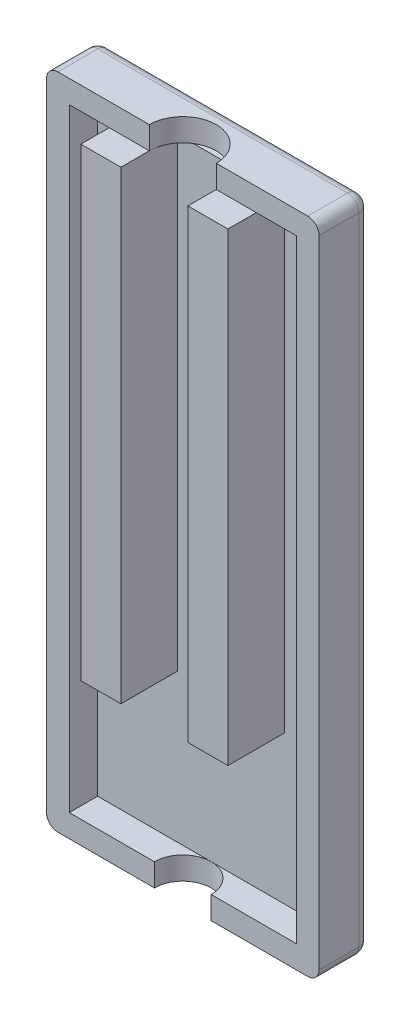
ISO-10303-21;
HEADER;
FILE_DESCRIPTION(('STEP AP214'),'2;1');
FILE_NAME('part.step','',(''),(''),'','','');
FILE_SCHEMA(('AUTOMOTIVE_DESIGN { 1 0 10303 214 1 1 1 1 }'));
ENDSEC;
DATA;
#1=APPLICATION_CONTEXT('core data for automotive mechanical design processes');
#2=APPLICATION_PROTOCOL_DEFINITION('international standard','automotive_design',2000,#1);
#3=PRODUCT_CONTEXT('',#1,'mechanical');
#4=PRODUCT('Part','Part','',(#3));
#5=PRODUCT_RELATED_PRODUCT_CATEGORY('part','',(#4));
#6=PRODUCT_DEFINITION_FORMATION('','',#4);
#7=PRODUCT_DEFINITION_CONTEXT('part definition',#1,'design');
#8=PRODUCT_DEFINITION('design','',#6,#7);
#9=PRODUCT_DEFINITION_SHAPE('','',#8);
#10=(LENGTH_UNIT() NAMED_UNIT(*) SI_UNIT(.MILLI.,.METRE.));
#11=(NAMED_UNIT(*) PLANE_ANGLE_UNIT() SI_UNIT($,.RADIAN.));
#12=(NAMED_UNIT(*) SI_UNIT($,.STERADIAN.) SOLID_ANGLE_UNIT());
#13=UNCERTAINTY_MEASURE_WITH_UNIT(LENGTH_MEASURE(1.E-05),#10,'distance_accuracy_value','');
#14=(GEOMETRIC_REPRESENTATION_CONTEXT(3) GLOBAL_UNCERTAINTY_ASSIGNED_CONTEXT((#13)) GLOBAL_UNIT_ASSIGNED_CONTEXT((#10,
#11,#12)) REPRESENTATION_CONTEXT('',''));
#15=CARTESIAN_POINT('',(0.,0.,0.));
#16=DIRECTION('',(0.,0.,1.));
#17=DIRECTION('',(1.,0.,0.));
#18=AXIS2_PLACEMENT_3D('',#15,#16,#17);
#19=CARTESIAN_POINT('',(0.,0.,2.));
#20=DIRECTION('',(0.,0.,1.));
#21=DIRECTION('',(1.,0.,0.));
#22=AXIS2_PLACEMENT_3D('',#19,#20,#21);
#23=PLANE('',#22);
#24=DIRECTION('',(1.,0.,0.));
#25=VECTOR('',#24,1.);
#26=CARTESIAN_POINT('',(2.95000000000001,-9.92651978231253,2.));
#27=LINE('',#26,#25);
#28=CARTESIAN_POINT('',(2.95000000000001,-9.92651978231253,2.));
#29=VERTEX_POINT('',#28);
#30=CARTESIAN_POINT('',(6.475,-9.92651978231253,2.));
#31=VERTEX_POINT('',#30);
#32=EDGE_CURVE('E265',#29,#31,#27,.T.);
#33=ORIENTED_EDGE('',*,*,#32,.F.);
#34=DIRECTION('',(0.,-1.,0.));
#35=VECTOR('',#34,1.);
#36=CARTESIAN_POINT('',(2.95,31.,2.));
#37=LINE('',#36,#35);
#38=CARTESIAN_POINT('',(2.95,31.,2.));
#39=VERTEX_POINT('',#38);
#40=EDGE_CURVE('E289',#39,#29,#37,.T.);
#41=ORIENTED_EDGE('',*,*,#40,.F.);
#42=DIRECTION('',(1.,0.,0.));
#43=VECTOR('',#42,1.);
#44=CARTESIAN_POINT('',(0.,31.,2.));
#45=LINE('',#44,#43);
#46=CARTESIAN_POINT('',(1.56604597633659,31.,2.));
#47=VERTEX_POINT('',#46);
#48=EDGE_CURVE('E552',#47,#39,#45,.T.);
#49=ORIENTED_EDGE('',*,*,#48,.F.);
#50=CARTESIAN_POINT('',(-1.56604597633658,31.,2.));
#51=VERTEX_POINT('',#50);
#52=EDGE_CURVE('E403',#51,#47,#45,.T.);
#53=ORIENTED_EDGE('',*,*,#52,.F.);
#54=CARTESIAN_POINT('',(-2.95,31.,2.));
#55=VERTEX_POINT('',#54);
#56=EDGE_CURVE('E402',#55,#51,#45,.T.);
#57=ORIENTED_EDGE('',*,*,#56,.F.);
#58=DIRECTION('',(0.,1.,0.));
#59=VECTOR('',#58,1.);
#60=CARTESIAN_POINT('',(-2.95,31.,2.));
#61=LINE('',#60,#59);
#62=CARTESIAN_POINT('',(-2.95,-9.92651978231253,2.));
#63=VERTEX_POINT('',#62);
#64=EDGE_CURVE('E275',#63,#55,#61,.T.);
#65=ORIENTED_EDGE('',*,*,#64,.F.);
#66=DIRECTION('',(1.,0.,0.));
#67=VECTOR('',#66,1.);
#68=CARTESIAN_POINT('',(-2.95,-9.92651978231253,2.));
#69=LINE('',#68,#67);
#70=CARTESIAN_POINT('',(-6.475,-9.92651978231253,2.));
#71=VERTEX_POINT('',#70);
#72=EDGE_CURVE('E288',#71,#63,#69,.T.);
#73=ORIENTED_EDGE('',*,*,#72,.F.);
#74=DIRECTION('',(0.,-1.,0.));
#75=VECTOR('',#74,1.);
#76=CARTESIAN_POINT('',(-6.475,31.,2.));
#77=LINE('',#76,#75);
#78=CARTESIAN_POINT('',(-6.475,31.,2.));
#79=VERTEX_POINT('',#78);
#80=EDGE_CURVE('E285',#79,#71,#77,.T.);
#81=ORIENTED_EDGE('',*,*,#80,.F.);
#82=CARTESIAN_POINT('',(-10.,31.,2.));
#83=VERTEX_POINT('',#82);
#84=EDGE_CURVE('E354',#83,#79,#45,.T.);
#85=ORIENTED_EDGE('',*,*,#84,.F.);
#86=DIRECTION('',(0.,-1.,0.));
#87=VECTOR('',#86,1.);
#88=CARTESIAN_POINT('',(-10.,0.,2.));
#89=LINE('',#88,#87);
#90=CARTESIAN_POINT('',(-9.99999999999999,-23.,2.));
#91=VERTEX_POINT('',#90);
#92=EDGE_CURVE('E394',#83,#91,#89,.T.);
#93=ORIENTED_EDGE('',*,*,#92,.T.);
#94=DIRECTION('',(1.,0.,0.));
#95=VECTOR('',#94,1.);
#96=CARTESIAN_POINT('',(0.,-23.,2.));
#97=LINE('',#96,#95);
#98=CARTESIAN_POINT('',(0.,-23.,2.));
#99=VERTEX_POINT('',#98);
#100=EDGE_CURVE('E390',#91,#99,#97,.T.);
#101=ORIENTED_EDGE('',*,*,#100,.T.);
#102=CARTESIAN_POINT('',(10.,-23.,2.));
#103=VERTEX_POINT('',#102);
#104=EDGE_CURVE('E389',#99,#103,#97,.T.);
#105=ORIENTED_EDGE('',*,*,#104,.T.);
#106=DIRECTION('',(0.,1.,0.));
#107=VECTOR('',#106,1.);
#108=CARTESIAN_POINT('',(10.,0.,2.));
#109=LINE('',#108,#107);
#110=CARTESIAN_POINT('',(10.,31.,2.));
#111=VERTEX_POINT('',#110);
#112=EDGE_CURVE('E345',#103,#111,#109,.T.);
#113=ORIENTED_EDGE('',*,*,#112,.T.);
#114=CARTESIAN_POINT('',(6.475,31.,2.));
#115=VERTEX_POINT('',#114);
#116=EDGE_CURVE('E398',#115,#111,#45,.T.);
#117=ORIENTED_EDGE('',*,*,#116,.F.);
#118=DIRECTION('',(0.,1.,0.));
#119=VECTOR('',#118,1.);
#120=CARTESIAN_POINT('',(6.475,31.,2.));
#121=LINE('',#120,#119);
#122=EDGE_CURVE('E260',#31,#115,#121,.T.);
#123=ORIENTED_EDGE('',*,*,#122,.F.);
#124=EDGE_LOOP('',(#33,#41,#49,#53,#57,#65,#73,#81,#85,#93,#101,#105,#113,#117,#123));
#125=FACE_BOUND('',#124,.T.);
#126=ADVANCED_FACE('F45',(#125),#23,.T.);
#127=CARTESIAN_POINT('',(0.,31.,4.5));
#128=DIRECTION('',(0.,1.,0.));
#129=DIRECTION('',(0.,0.,1.));
#130=AXIS2_PLACEMENT_3D('',#127,#128,#129);
#131=PLANE('',#130);
#132=DIRECTION('',(0.,0.,-1.));
#133=VECTOR('',#132,1.);
#134=CARTESIAN_POINT('',(2.95,31.,7.));
#135=LINE('',#134,#133);
#136=CARTESIAN_POINT('',(2.95,31.,4.5));
#137=VERTEX_POINT('',#136);
#138=EDGE_CURVE('E520',#137,#39,#135,.T.);
#139=ORIENTED_EDGE('',*,*,#138,.F.);
#140=CARTESIAN_POINT('',(0.,31.,4.5));
#141=DIRECTION('',(0.,-1.,0.));
#142=DIRECTION('',(0.,0.,-1.));
#143=AXIS2_PLACEMENT_3D('',#140,#141,#142);
#144=CIRCLE('',#143,2.95);
#145=EDGE_CURVE('E327',#47,#137,#144,.T.);
#146=ORIENTED_EDGE('',*,*,#145,.F.);
#147=ORIENTED_EDGE('',*,*,#48,.T.);
#148=EDGE_LOOP('',(#139,#146,#147));
#149=FACE_BOUND('',#148,.T.);
#150=ADVANCED_FACE('F569',(#149),#131,.F.);
#151=DIRECTION('',(0.,0.,-1.));
#152=VECTOR('',#151,1.);
#153=CARTESIAN_POINT('',(6.475,31.,7.));
#154=LINE('',#153,#152);
#155=CARTESIAN_POINT('',(6.475,31.,4.5));
#156=VERTEX_POINT('',#155);
#157=EDGE_CURVE('E251',#156,#115,#154,.T.);
#158=ORIENTED_EDGE('',*,*,#157,.T.);
#159=ORIENTED_EDGE('',*,*,#116,.T.);
#160=DIRECTION('',(0.,0.,-1.));
#161=VECTOR('',#160,1.);
#162=CARTESIAN_POINT('',(10.,31.,4.5));
#163=LINE('',#162,#161);
#164=CARTESIAN_POINT('',(10.,31.,4.5));
#165=VERTEX_POINT('',#164);
#166=EDGE_CURVE('E385',#165,#111,#163,.T.);
#167=ORIENTED_EDGE('',*,*,#166,.F.);
#168=DIRECTION('',(1.,0.,0.));
#169=VECTOR('',#168,1.);
#170=CARTESIAN_POINT('',(0.,31.,4.5));
#171=LINE('',#170,#169);
#172=EDGE_CURVE('E363',#156,#165,#171,.T.);
#173=ORIENTED_EDGE('',*,*,#172,.F.);
#174=EDGE_LOOP('',(#158,#159,#167,#173));
#175=FACE_BOUND('',#174,.T.);
#176=ADVANCED_FACE('F547',(#175),#131,.F.);
#177=DIRECTION('',(0.,0.,-1.));
#178=VECTOR('',#177,1.);
#179=CARTESIAN_POINT('',(-6.475,31.,7.));
#180=LINE('',#179,#178);
#181=CARTESIAN_POINT('',(-6.475,31.,4.5));
#182=VERTEX_POINT('',#181);
#183=EDGE_CURVE('E306',#182,#79,#180,.T.);
#184=ORIENTED_EDGE('',*,*,#183,.F.);
#185=CARTESIAN_POINT('',(-10.,31.,4.5));
#186=VERTEX_POINT('',#185);
#187=EDGE_CURVE('E364',#186,#182,#171,.T.);
#188=ORIENTED_EDGE('',*,*,#187,.F.);
#189=DIRECTION('',(0.,0.,-1.));
#190=VECTOR('',#189,1.);
#191=CARTESIAN_POINT('',(-10.,31.,4.5));
#192=LINE('',#191,#190);
#193=EDGE_CURVE('E407',#186,#83,#192,.T.);
#194=ORIENTED_EDGE('',*,*,#193,.T.);
#195=ORIENTED_EDGE('',*,*,#84,.T.);
#196=EDGE_LOOP('',(#184,#188,#194,#195));
#197=FACE_BOUND('',#196,.T.);
#198=ADVANCED_FACE('F576',(#197),#131,.F.);
#199=DIRECTION('',(0.,0.,-1.));
#200=VECTOR('',#199,1.);
#201=CARTESIAN_POINT('',(-2.95,31.,7.));
#202=LINE('',#201,#200);
#203=CARTESIAN_POINT('',(-2.95,31.,4.5));
#204=VERTEX_POINT('',#203);
#205=EDGE_CURVE('E284',#204,#55,#202,.T.);
#206=ORIENTED_EDGE('',*,*,#205,.T.);
#207=ORIENTED_EDGE('',*,*,#56,.T.);
#208=EDGE_CURVE('E336',#204,#51,#144,.T.);
#209=ORIENTED_EDGE('',*,*,#208,.F.);
#210=EDGE_LOOP('',(#206,#207,#209));
#211=FACE_BOUND('',#210,.T.);
#212=ADVANCED_FACE('F687',(#211),#131,.F.);
#213=CARTESIAN_POINT('',(0.,-23.,4.5));
#214=DIRECTION('',(0.,1.,0.));
#215=DIRECTION('',(0.,0.,1.));
#216=AXIS2_PLACEMENT_3D('',#213,#214,#215);
#217=PLANE('',#216);
#218=CARTESIAN_POINT('',(0.,-23.,4.5));
#219=DIRECTION('',(0.,1.,0.));
#220=DIRECTION('',(0.,0.,1.));
#221=AXIS2_PLACEMENT_3D('',#218,#219,#220);
#222=CIRCLE('',#221,2.5);
#223=CARTESIAN_POINT('',(2.5,-23.,4.5));
#224=VERTEX_POINT('',#223);
#225=EDGE_CURVE('E321',#224,#99,#222,.T.);
#226=ORIENTED_EDGE('',*,*,#225,.F.);
#227=DIRECTION('',(1.,0.,0.));
#228=VECTOR('',#227,1.);
#229=CARTESIAN_POINT('',(0.,-23.,4.5));
#230=LINE('',#229,#228);
#231=CARTESIAN_POINT('',(10.,-23.,4.5));
#232=VERTEX_POINT('',#231);
#233=EDGE_CURVE('E353',#224,#232,#230,.T.);
#234=ORIENTED_EDGE('',*,*,#233,.T.);
#235=DIRECTION('',(0.,0.,-1.));
#236=VECTOR('',#235,1.);
#237=CARTESIAN_POINT('',(10.,-23.,4.5));
#238=LINE('',#237,#236);
#239=EDGE_CURVE('E414',#232,#103,#238,.T.);
#240=ORIENTED_EDGE('',*,*,#239,.T.);
#241=ORIENTED_EDGE('',*,*,#104,.F.);
#242=EDGE_LOOP('',(#226,#234,#240,#241));
#243=FACE_BOUND('',#242,.T.);
#244=ADVANCED_FACE('F710',(#243),#217,.T.);
#245=CARTESIAN_POINT('',(0.,0.,4.5));
#246=DIRECTION('',(0.,0.,1.));
#247=DIRECTION('',(1.,0.,0.));
#248=AXIS2_PLACEMENT_3D('',#245,#246,#247);
#249=PLANE('',#248);
#250=DIRECTION('',(1.,0.,0.));
#251=VECTOR('',#250,1.);
#252=CARTESIAN_POINT('',(0.,-25.,4.5));
#253=LINE('',#252,#251);
#254=CARTESIAN_POINT('',(2.5,-25.,4.5));
#255=VERTEX_POINT('',#254);
#256=CARTESIAN_POINT('',(11.,-25.,4.5));
#257=VERTEX_POINT('',#256);
#258=EDGE_CURVE('E368',#255,#257,#253,.T.);
#259=ORIENTED_EDGE('',*,*,#258,.T.);
#260=CARTESIAN_POINT('',(11.,-24.,4.5));
#261=DIRECTION('',(0.,0.,1.));
#262=DIRECTION('',(1.,0.,0.));
#263=AXIS2_PLACEMENT_3D('',#260,#261,#262);
#264=CIRCLE('',#263,1.);
#265=CARTESIAN_POINT('',(12.,-24.,4.5));
#266=VERTEX_POINT('',#265);
#267=EDGE_CURVE('E440',#257,#266,#264,.T.);
#268=ORIENTED_EDGE('',*,*,#267,.T.);
#269=DIRECTION('',(0.,1.,0.));
#270=VECTOR('',#269,1.);
#271=CARTESIAN_POINT('',(12.,0.,4.5));
#272=LINE('',#271,#270);
#273=CARTESIAN_POINT('',(12.,32.,4.5));
#274=VERTEX_POINT('',#273);
#275=EDGE_CURVE('E373',#266,#274,#272,.T.);
#276=ORIENTED_EDGE('',*,*,#275,.T.);
#277=CARTESIAN_POINT('',(11.,32.,4.5));
#278=DIRECTION('',(0.,0.,1.));
#279=DIRECTION('',(1.,0.,0.));
#280=AXIS2_PLACEMENT_3D('',#277,#278,#279);
#281=CIRCLE('',#280,1.);
#282=CARTESIAN_POINT('',(11.,33.,4.5));
#283=VERTEX_POINT('',#282);
#284=EDGE_CURVE('E437',#274,#283,#281,.T.);
#285=ORIENTED_EDGE('',*,*,#284,.T.);
#286=DIRECTION('',(-1.,0.,0.));
#287=VECTOR('',#286,1.);
#288=CARTESIAN_POINT('',(0.,33.,4.5));
#289=LINE('',#288,#287);
#290=CARTESIAN_POINT('',(2.95,33.,4.5));
#291=VERTEX_POINT('',#290);
#292=EDGE_CURVE('E378',#283,#291,#289,.T.);
#293=ORIENTED_EDGE('',*,*,#292,.T.);
#294=DIRECTION('',(0.,-1.,0.));
#295=VECTOR('',#294,1.);
#296=CARTESIAN_POINT('',(2.95,33.,4.5));
#297=LINE('',#296,#295);
#298=EDGE_CURVE('E335',#291,#137,#297,.T.);
#299=ORIENTED_EDGE('',*,*,#298,.T.);
#300=EDGE_CURVE('E369',#137,#156,#171,.T.);
#301=ORIENTED_EDGE('',*,*,#300,.T.);
#302=ORIENTED_EDGE('',*,*,#172,.T.);
#303=DIRECTION('',(0.,1.,0.));
#304=VECTOR('',#303,1.);
#305=CARTESIAN_POINT('',(10.,0.,4.5));
#306=LINE('',#305,#304);
#307=EDGE_CURVE('E349',#232,#165,#306,.T.);
#308=ORIENTED_EDGE('',*,*,#307,.F.);
#309=ORIENTED_EDGE('',*,*,#233,.F.);
#310=DIRECTION('',(0.,1.,0.));
#311=VECTOR('',#310,1.);
#312=CARTESIAN_POINT('',(2.5,-25.,4.5));
#313=LINE('',#312,#311);
#314=EDGE_CURVE('E324',#255,#224,#313,.T.);
#315=ORIENTED_EDGE('',*,*,#314,.F.);
#316=EDGE_LOOP('',(#259,#268,#276,#285,#293,#299,#301,#302,#308,#309,#315));
#317=FACE_BOUND('',#316,.T.);
#318=ADVANCED_FACE('F599',(#317),#249,.T.);
#319=CARTESIAN_POINT('',(12.,33.,2.));
#320=DIRECTION('',(-1.,0.,0.));
#321=DIRECTION('',(0.,-1.,0.));
#322=AXIS2_PLACEMENT_3D('',#319,#320,#321);
#323=PLANE('',#322);
#324=ORIENTED_EDGE('',*,*,#275,.F.);
#325=DIRECTION('',(0.,0.,-1.));
#326=VECTOR('',#325,1.);
#327=CARTESIAN_POINT('',(12.,-24.,2.));
#328=LINE('',#327,#326);
#329=CARTESIAN_POINT('',(12.,-24.,1.));
#330=VERTEX_POINT('',#329);
#331=EDGE_CURVE('E424',#266,#330,#328,.T.);
#332=ORIENTED_EDGE('',*,*,#331,.T.);
#333=DIRECTION('',(0.,1.,0.));
#334=VECTOR('',#333,1.);
#335=CARTESIAN_POINT('',(12.,33.,1.));
#336=LINE('',#335,#334);
#337=CARTESIAN_POINT('',(12.,32.,1.));
#338=VERTEX_POINT('',#337);
#339=EDGE_CURVE('E421',#330,#338,#336,.T.);
#340=ORIENTED_EDGE('',*,*,#339,.T.);
#341=DIRECTION('',(0.,0.,-1.));
#342=VECTOR('',#341,1.);
#343=CARTESIAN_POINT('',(12.,32.,2.));
#344=LINE('',#343,#342);
#345=EDGE_CURVE('E418',#338,#274,#344,.F.);
#346=ORIENTED_EDGE('',*,*,#345,.T.);
#347=EDGE_LOOP('',(#324,#332,#340,#346));
#348=FACE_BOUND('',#347,.T.);
#349=ADVANCED_FACE('F596',(#348),#323,.F.);
#350=CARTESIAN_POINT('',(-12.,33.,2.));
#351=DIRECTION('',(0.,-1.,0.));
#352=DIRECTION('',(1.,0.,0.));
#353=AXIS2_PLACEMENT_3D('',#350,#351,#352);
#354=PLANE('',#353);
#355=DIRECTION('',(-1.,0.,0.));
#356=VECTOR('',#355,1.);
#357=CARTESIAN_POINT('',(-12.,33.,1.));
#358=LINE('',#357,#356);
#359=CARTESIAN_POINT('',(11.,33.,1.));
#360=VERTEX_POINT('',#359);
#361=CARTESIAN_POINT('',(-11.,33.,1.));
#362=VERTEX_POINT('',#361);
#363=EDGE_CURVE('E55',#360,#362,#358,.T.);
#364=ORIENTED_EDGE('',*,*,#363,.T.);
#365=DIRECTION('',(0.,0.,-1.));
#366=VECTOR('',#365,1.);
#367=CARTESIAN_POINT('',(-11.,33.,2.));
#368=LINE('',#367,#366);
#369=CARTESIAN_POINT('',(-11.,33.,4.5));
#370=VERTEX_POINT('',#369);
#371=EDGE_CURVE('E11',#362,#370,#368,.F.);
#372=ORIENTED_EDGE('',*,*,#371,.T.);
#373=CARTESIAN_POINT('',(-2.95,33.,4.5));
#374=VERTEX_POINT('',#373);
#375=EDGE_CURVE('E377',#374,#370,#289,.T.);
#376=ORIENTED_EDGE('',*,*,#375,.F.);
#377=CARTESIAN_POINT('',(0.,33.,4.5));
#378=DIRECTION('',(0.,-1.,0.));
#379=DIRECTION('',(0.,0.,-1.));
#380=AXIS2_PLACEMENT_3D('',#377,#378,#379);
#381=CIRCLE('',#380,2.95);
#382=EDGE_CURVE('E331',#374,#291,#381,.T.);
#383=ORIENTED_EDGE('',*,*,#382,.T.);
#384=ORIENTED_EDGE('',*,*,#292,.F.);
#385=DIRECTION('',(0.,0.,-1.));
#386=VECTOR('',#385,1.);
#387=CARTESIAN_POINT('',(11.,33.,2.));
#388=LINE('',#387,#386);
#389=EDGE_CURVE('E66',#283,#360,#388,.T.);
#390=ORIENTED_EDGE('',*,*,#389,.T.);
#391=EDGE_LOOP('',(#364,#372,#376,#383,#384,#390));
#392=FACE_BOUND('',#391,.T.);
#393=ADVANCED_FACE('F592',(#392),#354,.F.);
#394=CARTESIAN_POINT('',(-12.,33.,2.));
#395=DIRECTION('',(1.,0.,0.));
#396=DIRECTION('',(0.,1.,0.));
#397=AXIS2_PLACEMENT_3D('',#394,#395,#396);
#398=PLANE('',#397);
#399=DIRECTION('',(0.,-1.,0.));
#400=VECTOR('',#399,1.);
#401=CARTESIAN_POINT('',(-12.,33.,1.));
#402=LINE('',#401,#400);
#403=CARTESIAN_POINT('',(-12.,32.,1.));
#404=VERTEX_POINT('',#403);
#405=CARTESIAN_POINT('',(-12.,-24.,1.));
#406=VERTEX_POINT('',#405);
#407=EDGE_CURVE('E459',#404,#406,#402,.T.);
#408=ORIENTED_EDGE('',*,*,#407,.T.);
#409=DIRECTION('',(0.,0.,-1.));
#410=VECTOR('',#409,1.);
#411=CARTESIAN_POINT('',(-12.,-24.,2.));
#412=LINE('',#411,#410);
#413=CARTESIAN_POINT('',(-12.,-24.,4.5));
#414=VERTEX_POINT('',#413);
#415=EDGE_CURVE('E462',#406,#414,#412,.F.);
#416=ORIENTED_EDGE('',*,*,#415,.T.);
#417=DIRECTION('',(0.,-1.,0.));
#418=VECTOR('',#417,1.);
#419=CARTESIAN_POINT('',(-12.,0.,4.5));
#420=LINE('',#419,#418);
#421=CARTESIAN_POINT('',(-12.,32.,4.5));
#422=VERTEX_POINT('',#421);
#423=EDGE_CURVE('E381',#422,#414,#420,.T.);
#424=ORIENTED_EDGE('',*,*,#423,.F.);
#425=DIRECTION('',(0.,0.,-1.));
#426=VECTOR('',#425,1.);
#427=CARTESIAN_POINT('',(-12.,32.,2.));
#428=LINE('',#427,#426);
#429=EDGE_CURVE('E456',#422,#404,#428,.T.);
#430=ORIENTED_EDGE('',*,*,#429,.T.);
#431=EDGE_LOOP('',(#408,#416,#424,#430));
#432=FACE_BOUND('',#431,.T.);
#433=ADVANCED_FACE('F588',(#432),#398,.F.);
#434=CARTESIAN_POINT('',(-12.,-25.,2.));
#435=DIRECTION('',(0.,1.,0.));
#436=DIRECTION('',(0.,0.,1.));
#437=AXIS2_PLACEMENT_3D('',#434,#435,#436);
#438=PLANE('',#437);
#439=DIRECTION('',(1.,0.,0.));
#440=VECTOR('',#439,1.);
#441=CARTESIAN_POINT('',(-12.,-25.,1.));
#442=LINE('',#441,#440);
#443=CARTESIAN_POINT('',(-11.,-25.,1.));
#444=VERTEX_POINT('',#443);
#445=CARTESIAN_POINT('',(11.,-25.,1.));
#446=VERTEX_POINT('',#445);
#447=EDGE_CURVE('E431',#444,#446,#442,.T.);
#448=ORIENTED_EDGE('',*,*,#447,.T.);
#449=DIRECTION('',(0.,0.,-1.));
#450=VECTOR('',#449,1.);
#451=CARTESIAN_POINT('',(11.,-25.,2.));
#452=LINE('',#451,#450);
#453=EDGE_CURVE('E434',#446,#257,#452,.F.);
#454=ORIENTED_EDGE('',*,*,#453,.T.);
#455=ORIENTED_EDGE('',*,*,#258,.F.);
#456=CARTESIAN_POINT('',(0.,-25.,4.5));
#457=DIRECTION('',(0.,1.,0.));
#458=DIRECTION('',(0.,0.,1.));
#459=AXIS2_PLACEMENT_3D('',#456,#457,#458);
#460=CIRCLE('',#459,2.5);
#461=CARTESIAN_POINT('',(-2.5,-25.,4.5));
#462=VERTEX_POINT('',#461);
#463=EDGE_CURVE('E316',#255,#462,#460,.T.);
#464=ORIENTED_EDGE('',*,*,#463,.T.);
#465=CARTESIAN_POINT('',(-11.,-25.,4.5));
#466=VERTEX_POINT('',#465);
#467=EDGE_CURVE('E370',#466,#462,#253,.T.);
#468=ORIENTED_EDGE('',*,*,#467,.F.);
#469=DIRECTION('',(0.,0.,-1.));
#470=VECTOR('',#469,1.);
#471=CARTESIAN_POINT('',(-11.,-25.,2.));
#472=LINE('',#471,#470);
#473=EDGE_CURVE('E428',#466,#444,#472,.T.);
#474=ORIENTED_EDGE('',*,*,#473,.T.);
#475=EDGE_LOOP('',(#448,#454,#455,#464,#468,#474));
#476=FACE_BOUND('',#475,.T.);
#477=ADVANCED_FACE('F584',(#476),#438,.F.);
#478=CARTESIAN_POINT('',(0.,0.,0.));
#479=DIRECTION('',(0.,0.,1.));
#480=DIRECTION('',(1.,0.,0.));
#481=AXIS2_PLACEMENT_3D('',#478,#479,#480);
#482=PLANE('',#481);
#483=DIRECTION('',(0.,1.,0.));
#484=VECTOR('',#483,1.);
#485=CARTESIAN_POINT('',(11.,0.,0.));
#486=LINE('',#485,#484);
#487=CARTESIAN_POINT('',(11.,32.,0.));
#488=VERTEX_POINT('',#487);
#489=CARTESIAN_POINT('',(11.,-24.,0.));
#490=VERTEX_POINT('',#489);
#491=EDGE_CURVE('E443',#488,#490,#486,.F.);
#492=ORIENTED_EDGE('',*,*,#491,.T.);
#493=DIRECTION('',(1.,0.,0.));
#494=VECTOR('',#493,1.);
#495=CARTESIAN_POINT('',(0.,-24.,0.));
#496=LINE('',#495,#494);
#497=CARTESIAN_POINT('',(-11.,-24.,0.));
#498=VERTEX_POINT('',#497);
#499=EDGE_CURVE('E452',#490,#498,#496,.F.);
#500=ORIENTED_EDGE('',*,*,#499,.T.);
#501=DIRECTION('',(0.,-1.,0.));
#502=VECTOR('',#501,1.);
#503=CARTESIAN_POINT('',(-11.,0.,0.));
#504=LINE('',#503,#502);
#505=CARTESIAN_POINT('',(-11.,32.,0.));
#506=VERTEX_POINT('',#505);
#507=EDGE_CURVE('E449',#498,#506,#504,.F.);
#508=ORIENTED_EDGE('',*,*,#507,.T.);
#509=DIRECTION('',(-1.,0.,0.));
#510=VECTOR('',#509,1.);
#511=CARTESIAN_POINT('',(0.,32.,0.));
#512=LINE('',#511,#510);
#513=EDGE_CURVE('E446',#506,#488,#512,.F.);
#514=ORIENTED_EDGE('',*,*,#513,.T.);
#515=EDGE_LOOP('',(#492,#500,#508,#514));
#516=FACE_BOUND('',#515,.T.);
#517=ADVANCED_FACE('F581',(#516),#482,.F.);
#518=CARTESIAN_POINT('',(10.,0.,4.5));
#519=DIRECTION('',(-1.,0.,0.));
#520=DIRECTION('',(0.,0.,1.));
#521=AXIS2_PLACEMENT_3D('',#518,#519,#520);
#522=PLANE('',#521);
#523=ORIENTED_EDGE('',*,*,#112,.F.);
#524=ORIENTED_EDGE('',*,*,#239,.F.);
#525=ORIENTED_EDGE('',*,*,#307,.T.);
#526=ORIENTED_EDGE('',*,*,#166,.T.);
#527=EDGE_LOOP('',(#523,#524,#525,#526));
#528=FACE_BOUND('',#527,.T.);
#529=ADVANCED_FACE('F579',(#528),#522,.T.);
#530=CARTESIAN_POINT('',(-2.5,-23.,4.5));
#531=VERTEX_POINT('',#530);
#532=EDGE_CURVE('E315',#99,#531,#222,.T.);
#533=ORIENTED_EDGE('',*,*,#532,.F.);
#534=ORIENTED_EDGE('',*,*,#100,.F.);
#535=DIRECTION('',(0.,0.,-1.));
#536=VECTOR('',#535,1.);
#537=CARTESIAN_POINT('',(-9.99999999999999,-23.,4.5));
#538=LINE('',#537,#536);
#539=CARTESIAN_POINT('',(-9.99999999999999,-23.,4.5));
#540=VERTEX_POINT('',#539);
#541=EDGE_CURVE('E411',#540,#91,#538,.T.);
#542=ORIENTED_EDGE('',*,*,#541,.F.);
#543=EDGE_CURVE('E355',#540,#531,#230,.T.);
#544=ORIENTED_EDGE('',*,*,#543,.T.);
#545=EDGE_LOOP('',(#533,#534,#542,#544));
#546=FACE_BOUND('',#545,.T.);
#547=ADVANCED_FACE('F715',(#546),#217,.T.);
#548=CARTESIAN_POINT('',(-10.,0.,4.5));
#549=DIRECTION('',(1.,0.,0.));
#550=DIRECTION('',(0.,1.,0.));
#551=AXIS2_PLACEMENT_3D('',#548,#549,#550);
#552=PLANE('',#551);
#553=ORIENTED_EDGE('',*,*,#92,.F.);
#554=ORIENTED_EDGE('',*,*,#193,.F.);
#555=DIRECTION('',(0.,-1.,0.));
#556=VECTOR('',#555,1.);
#557=CARTESIAN_POINT('',(-10.,0.,4.5));
#558=LINE('',#557,#556);
#559=EDGE_CURVE('E359',#186,#540,#558,.T.);
#560=ORIENTED_EDGE('',*,*,#559,.T.);
#561=ORIENTED_EDGE('',*,*,#541,.T.);
#562=EDGE_LOOP('',(#553,#554,#560,#561));
#563=FACE_BOUND('',#562,.T.);
#564=ADVANCED_FACE('F719',(#563),#552,.T.);
#565=ORIENTED_EDGE('',*,*,#423,.T.);
#566=CARTESIAN_POINT('',(-11.,-24.,4.5));
#567=DIRECTION('',(0.,0.,1.));
#568=DIRECTION('',(1.,0.,0.));
#569=AXIS2_PLACEMENT_3D('',#566,#567,#568);
#570=CIRCLE('',#569,1.);
#571=EDGE_CURVE('E468',#414,#466,#570,.T.);
#572=ORIENTED_EDGE('',*,*,#571,.T.);
#573=ORIENTED_EDGE('',*,*,#467,.T.);
#574=DIRECTION('',(0.,1.,0.));
#575=VECTOR('',#574,1.);
#576=CARTESIAN_POINT('',(-2.5,-25.,4.5));
#577=LINE('',#576,#575);
#578=EDGE_CURVE('E320',#462,#531,#577,.T.);
#579=ORIENTED_EDGE('',*,*,#578,.T.);
#580=ORIENTED_EDGE('',*,*,#543,.F.);
#581=ORIENTED_EDGE('',*,*,#559,.F.);
#582=ORIENTED_EDGE('',*,*,#187,.T.);
#583=DIRECTION('',(1.,0.,0.));
#584=VECTOR('',#583,1.);
#585=CARTESIAN_POINT('',(0.,31.,4.5));
#586=LINE('',#585,#584);
#587=EDGE_CURVE('E311',#182,#204,#586,.T.);
#588=ORIENTED_EDGE('',*,*,#587,.T.);
#589=DIRECTION('',(0.,-1.,0.));
#590=VECTOR('',#589,1.);
#591=CARTESIAN_POINT('',(-2.95,33.,4.5));
#592=LINE('',#591,#590);
#593=EDGE_CURVE('E341',#374,#204,#592,.T.);
#594=ORIENTED_EDGE('',*,*,#593,.F.);
#595=ORIENTED_EDGE('',*,*,#375,.T.);
#596=CARTESIAN_POINT('',(-11.,32.,4.5));
#597=DIRECTION('',(0.,0.,1.));
#598=DIRECTION('',(1.,0.,0.));
#599=AXIS2_PLACEMENT_3D('',#596,#597,#598);
#600=CIRCLE('',#599,1.);
#601=EDGE_CURVE('E465',#370,#422,#600,.T.);
#602=ORIENTED_EDGE('',*,*,#601,.T.);
#603=EDGE_LOOP('',(#565,#572,#573,#579,#580,#581,#582,#588,#594,#595,#602));
#604=FACE_BOUND('',#603,.T.);
#605=ADVANCED_FACE('F657',(#604),#249,.T.);
#606=CARTESIAN_POINT('',(0.,33.,4.5));
#607=DIRECTION('',(0.,-1.,0.));
#608=DIRECTION('',(0.,0.,-1.));
#609=AXIS2_PLACEMENT_3D('',#606,#607,#608);
#610=CYLINDRICAL_SURFACE('',#609,2.95);
#611=ORIENTED_EDGE('',*,*,#208,.T.);
#612=EDGE_CURVE('E340',#51,#47,#144,.T.);
#613=ORIENTED_EDGE('',*,*,#612,.T.);
#614=ORIENTED_EDGE('',*,*,#145,.T.);
#615=ORIENTED_EDGE('',*,*,#298,.F.);
#616=ORIENTED_EDGE('',*,*,#382,.F.);
#617=ORIENTED_EDGE('',*,*,#593,.T.);
#618=EDGE_LOOP('',(#611,#613,#614,#615,#616,#617));
#619=FACE_BOUND('',#618,.T.);
#620=ADVANCED_FACE('F698',(#619),#610,.F.);
#621=CARTESIAN_POINT('',(0.,31.,4.5));
#622=DIRECTION('',(0.,-1.,0.));
#623=DIRECTION('',(0.,0.,-1.));
#624=AXIS2_PLACEMENT_3D('',#621,#622,#623);
#625=PLANE('',#624);
#626=ORIENTED_EDGE('',*,*,#52,.T.);
#627=ORIENTED_EDGE('',*,*,#612,.F.);
#628=EDGE_LOOP('',(#626,#627));
#629=FACE_BOUND('',#628,.T.);
#630=ADVANCED_FACE('F695',(#629),#625,.F.);
#631=CARTESIAN_POINT('',(0.,-25.,4.5));
#632=DIRECTION('',(0.,1.,0.));
#633=DIRECTION('',(0.,0.,1.));
#634=AXIS2_PLACEMENT_3D('',#631,#632,#633);
#635=CYLINDRICAL_SURFACE('',#634,2.5);
#636=ORIENTED_EDGE('',*,*,#225,.T.);
#637=ORIENTED_EDGE('',*,*,#532,.T.);
#638=ORIENTED_EDGE('',*,*,#578,.F.);
#639=ORIENTED_EDGE('',*,*,#463,.F.);
#640=ORIENTED_EDGE('',*,*,#314,.T.);
#641=EDGE_LOOP('',(#636,#637,#638,#639,#640));
#642=FACE_BOUND('',#641,.T.);
#643=ADVANCED_FACE('F663',(#642),#635,.F.);
#644=CARTESIAN_POINT('',(-6.475,31.,7.));
#645=DIRECTION('',(0.,-1.,0.));
#646=DIRECTION('',(0.,0.,-1.));
#647=AXIS2_PLACEMENT_3D('',#644,#645,#646);
#648=PLANE('',#647);
#649=ORIENTED_EDGE('',*,*,#587,.F.);
#650=CARTESIAN_POINT('',(-6.475,31.,7.));
#651=VERTEX_POINT('',#650);
#652=EDGE_CURVE('E307',#651,#182,#180,.T.);
#653=ORIENTED_EDGE('',*,*,#652,.F.);
#654=DIRECTION('',(-1.,0.,0.));
#655=VECTOR('',#654,1.);
#656=CARTESIAN_POINT('',(-6.475,31.,7.));
#657=LINE('',#656,#655);
#658=CARTESIAN_POINT('',(-2.95,31.,7.));
#659=VERTEX_POINT('',#658);
#660=EDGE_CURVE('E270',#659,#651,#657,.T.);
#661=ORIENTED_EDGE('',*,*,#660,.F.);
#662=EDGE_CURVE('E295',#659,#204,#202,.T.);
#663=ORIENTED_EDGE('',*,*,#662,.T.);
#664=EDGE_LOOP('',(#649,#653,#661,#663));
#665=FACE_BOUND('',#664,.T.);
#666=ADVANCED_FACE('F736',(#665),#648,.F.);
#667=CARTESIAN_POINT('',(-6.475,31.,7.));
#668=DIRECTION('',(1.,0.,0.));
#669=DIRECTION('',(0.,1.,0.));
#670=AXIS2_PLACEMENT_3D('',#667,#668,#669);
#671=PLANE('',#670);
#672=ORIENTED_EDGE('',*,*,#80,.T.);
#673=DIRECTION('',(0.,0.,-1.));
#674=VECTOR('',#673,1.);
#675=CARTESIAN_POINT('',(-6.475,-9.92651978231253,7.));
#676=LINE('',#675,#674);
#677=CARTESIAN_POINT('',(-6.475,-9.92651978231253,7.));
#678=VERTEX_POINT('',#677);
#679=EDGE_CURVE('E302',#678,#71,#676,.T.);
#680=ORIENTED_EDGE('',*,*,#679,.F.);
#681=DIRECTION('',(0.,-1.,0.));
#682=VECTOR('',#681,1.);
#683=CARTESIAN_POINT('',(-6.475,31.,7.));
#684=LINE('',#683,#682);
#685=EDGE_CURVE('E274',#651,#678,#684,.T.);
#686=ORIENTED_EDGE('',*,*,#685,.F.);
#687=ORIENTED_EDGE('',*,*,#652,.T.);
#688=ORIENTED_EDGE('',*,*,#183,.T.);
#689=EDGE_LOOP('',(#672,#680,#686,#687,#688));
#690=FACE_BOUND('',#689,.T.);
#691=ADVANCED_FACE('F725',(#690),#671,.F.);
#692=CARTESIAN_POINT('',(-2.95,-9.92651978231253,7.));
#693=DIRECTION('',(0.,1.,0.));
#694=DIRECTION('',(-1.,0.,0.));
#695=AXIS2_PLACEMENT_3D('',#692,#693,#694);
#696=PLANE('',#695);
#697=ORIENTED_EDGE('',*,*,#72,.T.);
#698=DIRECTION('',(0.,0.,-1.));
#699=VECTOR('',#698,1.);
#700=CARTESIAN_POINT('',(-2.95,-9.92651978231253,7.));
#701=LINE('',#700,#699);
#702=CARTESIAN_POINT('',(-2.95,-9.92651978231253,7.));
#703=VERTEX_POINT('',#702);
#704=EDGE_CURVE('E299',#703,#63,#701,.T.);
#705=ORIENTED_EDGE('',*,*,#704,.F.);
#706=DIRECTION('',(1.,0.,0.));
#707=VECTOR('',#706,1.);
#708=CARTESIAN_POINT('',(-2.95,-9.92651978231253,7.));
#709=LINE('',#708,#707);
#710=EDGE_CURVE('E278',#678,#703,#709,.T.);
#711=ORIENTED_EDGE('',*,*,#710,.F.);
#712=ORIENTED_EDGE('',*,*,#679,.T.);
#713=EDGE_LOOP('',(#697,#705,#711,#712));
#714=FACE_BOUND('',#713,.T.);
#715=ADVANCED_FACE('F730',(#714),#696,.F.);
#716=CARTESIAN_POINT('',(-2.95,31.,7.));
#717=DIRECTION('',(-1.,0.,0.));
#718=DIRECTION('',(0.,-1.,0.));
#719=AXIS2_PLACEMENT_3D('',#716,#717,#718);
#720=PLANE('',#719);
#721=ORIENTED_EDGE('',*,*,#64,.T.);
#722=ORIENTED_EDGE('',*,*,#205,.F.);
#723=ORIENTED_EDGE('',*,*,#662,.F.);
#724=DIRECTION('',(0.,1.,0.));
#725=VECTOR('',#724,1.);
#726=CARTESIAN_POINT('',(-2.95,31.,7.));
#727=LINE('',#726,#725);
#728=EDGE_CURVE('E281',#703,#659,#727,.T.);
#729=ORIENTED_EDGE('',*,*,#728,.F.);
#730=ORIENTED_EDGE('',*,*,#704,.T.);
#731=EDGE_LOOP('',(#721,#722,#723,#729,#730));
#732=FACE_BOUND('',#731,.T.);
#733=ADVANCED_FACE('F737',(#732),#720,.F.);
#734=CARTESIAN_POINT('',(0.,0.,7.));
#735=DIRECTION('',(0.,0.,-1.));
#736=DIRECTION('',(-1.,0.,0.));
#737=AXIS2_PLACEMENT_3D('',#734,#735,#736);
#738=PLANE('',#737);
#739=ORIENTED_EDGE('',*,*,#660,.T.);
#740=ORIENTED_EDGE('',*,*,#685,.T.);
#741=ORIENTED_EDGE('',*,*,#710,.T.);
#742=ORIENTED_EDGE('',*,*,#728,.T.);
#743=EDGE_LOOP('',(#739,#740,#741,#742));
#744=FACE_BOUND('',#743,.T.);
#745=ADVANCED_FACE('F566',(#744),#738,.F.);
#746=CARTESIAN_POINT('',(6.475,31.,7.));
#747=DIRECTION('',(0.,-1.,0.));
#748=DIRECTION('',(0.,0.,-1.));
#749=AXIS2_PLACEMENT_3D('',#746,#747,#748);
#750=PLANE('',#749);
#751=ORIENTED_EDGE('',*,*,#300,.F.);
#752=CARTESIAN_POINT('',(2.95,31.,7.));
#753=VERTEX_POINT('',#752);
#754=EDGE_CURVE('E258',#753,#137,#135,.T.);
#755=ORIENTED_EDGE('',*,*,#754,.F.);
#756=DIRECTION('',(-1.,0.,0.));
#757=VECTOR('',#756,1.);
#758=CARTESIAN_POINT('',(6.475,31.,7.));
#759=LINE('',#758,#757);
#760=CARTESIAN_POINT('',(6.475,31.,7.));
#761=VERTEX_POINT('',#760);
#762=EDGE_CURVE('E237',#761,#753,#759,.T.);
#763=ORIENTED_EDGE('',*,*,#762,.F.);
#764=EDGE_CURVE('E245',#761,#156,#154,.T.);
#765=ORIENTED_EDGE('',*,*,#764,.T.);
#766=EDGE_LOOP('',(#751,#755,#763,#765));
#767=FACE_BOUND('',#766,.T.);
#768=ADVANCED_FACE('F256',(#767),#750,.F.);
#769=CARTESIAN_POINT('',(2.95,31.,7.));
#770=DIRECTION('',(1.,0.,0.));
#771=DIRECTION('',(0.,1.,0.));
#772=AXIS2_PLACEMENT_3D('',#769,#770,#771);
#773=PLANE('',#772);
#774=ORIENTED_EDGE('',*,*,#40,.T.);
#775=DIRECTION('',(0.,0.,-1.));
#776=VECTOR('',#775,1.);
#777=CARTESIAN_POINT('',(2.95000000000001,-9.92651978231253,7.));
#778=LINE('',#777,#776);
#779=CARTESIAN_POINT('',(2.95000000000001,-9.92651978231253,7.));
#780=VERTEX_POINT('',#779);
#781=EDGE_CURVE('E530',#780,#29,#778,.T.);
#782=ORIENTED_EDGE('',*,*,#781,.F.);
#783=DIRECTION('',(0.,-1.,0.));
#784=VECTOR('',#783,1.);
#785=CARTESIAN_POINT('',(2.95,31.,7.));
#786=LINE('',#785,#784);
#787=EDGE_CURVE('E261',#753,#780,#786,.T.);
#788=ORIENTED_EDGE('',*,*,#787,.F.);
#789=ORIENTED_EDGE('',*,*,#754,.T.);
#790=ORIENTED_EDGE('',*,*,#138,.T.);
#791=EDGE_LOOP('',(#774,#782,#788,#789,#790));
#792=FACE_BOUND('',#791,.T.);
#793=ADVANCED_FACE('F558',(#792),#773,.F.);
#794=CARTESIAN_POINT('',(2.95000000000001,-9.92651978231253,7.));
#795=DIRECTION('',(0.,1.,0.));
#796=DIRECTION('',(0.,0.,1.));
#797=AXIS2_PLACEMENT_3D('',#794,#795,#796);
#798=PLANE('',#797);
#799=ORIENTED_EDGE('',*,*,#32,.T.);
#800=DIRECTION('',(0.,0.,-1.));
#801=VECTOR('',#800,1.);
#802=CARTESIAN_POINT('',(6.475,-9.92651978231253,7.));
#803=LINE('',#802,#801);
#804=CARTESIAN_POINT('',(6.475,-9.92651978231253,7.));
#805=VERTEX_POINT('',#804);
#806=EDGE_CURVE('E535',#805,#31,#803,.T.);
#807=ORIENTED_EDGE('',*,*,#806,.F.);
#808=DIRECTION('',(1.,0.,0.));
#809=VECTOR('',#808,1.);
#810=CARTESIAN_POINT('',(2.95000000000001,-9.92651978231253,7.));
#811=LINE('',#810,#809);
#812=EDGE_CURVE('E240',#780,#805,#811,.T.);
#813=ORIENTED_EDGE('',*,*,#812,.F.);
#814=ORIENTED_EDGE('',*,*,#781,.T.);
#815=EDGE_LOOP('',(#799,#807,#813,#814));
#816=FACE_BOUND('',#815,.T.);
#817=ADVANCED_FACE('F554',(#816),#798,.F.);
#818=CARTESIAN_POINT('',(6.475,31.,7.));
#819=DIRECTION('',(-1.,0.,0.));
#820=DIRECTION('',(0.,-1.,0.));
#821=AXIS2_PLACEMENT_3D('',#818,#819,#820);
#822=PLANE('',#821);
#823=ORIENTED_EDGE('',*,*,#122,.T.);
#824=ORIENTED_EDGE('',*,*,#157,.F.);
#825=ORIENTED_EDGE('',*,*,#764,.F.);
#826=DIRECTION('',(0.,1.,0.));
#827=VECTOR('',#826,1.);
#828=CARTESIAN_POINT('',(6.475,31.,7.));
#829=LINE('',#828,#827);
#830=EDGE_CURVE('E233',#805,#761,#829,.T.);
#831=ORIENTED_EDGE('',*,*,#830,.F.);
#832=ORIENTED_EDGE('',*,*,#806,.T.);
#833=EDGE_LOOP('',(#823,#824,#825,#831,#832));
#834=FACE_BOUND('',#833,.T.);
#835=ADVANCED_FACE('F250',(#834),#822,.F.);
#836=CARTESIAN_POINT('',(0.,0.,7.));
#837=DIRECTION('',(0.,0.,1.));
#838=DIRECTION('',(1.,0.,0.));
#839=AXIS2_PLACEMENT_3D('',#836,#837,#838);
#840=PLANE('',#839);
#841=ORIENTED_EDGE('',*,*,#762,.T.);
#842=ORIENTED_EDGE('',*,*,#787,.T.);
#843=ORIENTED_EDGE('',*,*,#812,.T.);
#844=ORIENTED_EDGE('',*,*,#830,.T.);
#845=EDGE_LOOP('',(#841,#842,#843,#844));
#846=FACE_BOUND('',#845,.T.);
#847=ADVANCED_FACE('F235',(#846),#840,.T.);
#848=CARTESIAN_POINT('',(-11.,32.,2.));
#849=DIRECTION('',(0.,0.,-1.));
#850=DIRECTION('',(-1.,0.,0.));
#851=AXIS2_PLACEMENT_3D('',#848,#849,#850);
#852=CYLINDRICAL_SURFACE('',#851,1.);
#853=CARTESIAN_POINT('',(-11.,32.,1.));
#854=DIRECTION('',(0.,0.,-1.));
#855=DIRECTION('',(-1.,0.,0.));
#856=AXIS2_PLACEMENT_3D('',#853,#854,#855);
#857=CIRCLE('',#856,1.);
#858=EDGE_CURVE('E49',#404,#362,#857,.T.);
#859=ORIENTED_EDGE('',*,*,#858,.F.);
#860=ORIENTED_EDGE('',*,*,#429,.F.);
#861=ORIENTED_EDGE('',*,*,#601,.F.);
#862=ORIENTED_EDGE('',*,*,#371,.F.);
#863=EDGE_LOOP('',(#859,#860,#861,#862));
#864=FACE_BOUND('',#863,.T.);
#865=ADVANCED_FACE('F47',(#864),#852,.T.);
#866=CARTESIAN_POINT('',(-11.,32.,1.));
#867=DIRECTION('',(0.,1.,0.));
#868=DIRECTION('',(0.,0.,1.));
#869=AXIS2_PLACEMENT_3D('',#866,#867,#868);
#870=SPHERICAL_SURFACE('',#869,1.);
#871=CARTESIAN_POINT('',(-11.,32.,1.));
#872=DIRECTION('',(0.,1.,0.));
#873=DIRECTION('',(0.,0.,1.));
#874=AXIS2_PLACEMENT_3D('',#871,#872,#873);
#875=CIRCLE('',#874,1.);
#876=EDGE_CURVE('E509',#404,#506,#875,.F.);
#877=ORIENTED_EDGE('',*,*,#876,.F.);
#878=ORIENTED_EDGE('',*,*,#858,.T.);
#879=CARTESIAN_POINT('',(-11.,32.,1.));
#880=DIRECTION('',(-1.,0.,0.));
#881=DIRECTION('',(0.,0.,1.));
#882=AXIS2_PLACEMENT_3D('',#879,#880,#881);
#883=CIRCLE('',#882,1.);
#884=EDGE_CURVE('E512',#506,#362,#883,.F.);
#885=ORIENTED_EDGE('',*,*,#884,.F.);
#886=EDGE_LOOP('',(#877,#878,#885));
#887=FACE_BOUND('',#886,.T.);
#888=ADVANCED_FACE('F638',(#887),#870,.T.);
#889=CARTESIAN_POINT('',(11.,32.,2.));
#890=DIRECTION('',(0.,0.,-1.));
#891=DIRECTION('',(-1.,0.,0.));
#892=AXIS2_PLACEMENT_3D('',#889,#890,#891);
#893=CYLINDRICAL_SURFACE('',#892,1.);
#894=ORIENTED_EDGE('',*,*,#284,.F.);
#895=ORIENTED_EDGE('',*,*,#345,.F.);
#896=CARTESIAN_POINT('',(11.,32.,1.));
#897=DIRECTION('',(0.,0.,-1.));
#898=DIRECTION('',(-1.,0.,0.));
#899=AXIS2_PLACEMENT_3D('',#896,#897,#898);
#900=CIRCLE('',#899,1.);
#901=EDGE_CURVE('E505',#360,#338,#900,.T.);
#902=ORIENTED_EDGE('',*,*,#901,.F.);
#903=ORIENTED_EDGE('',*,*,#389,.F.);
#904=EDGE_LOOP('',(#894,#895,#902,#903));
#905=FACE_BOUND('',#904,.T.);
#906=ADVANCED_FACE('F636',(#905),#893,.T.);
#907=CARTESIAN_POINT('',(-12.,32.,1.));
#908=DIRECTION('',(-1.,0.,0.));
#909=DIRECTION('',(0.,-1.,0.));
#910=AXIS2_PLACEMENT_3D('',#907,#908,#909);
#911=CYLINDRICAL_SURFACE('',#910,1.);
#912=ORIENTED_EDGE('',*,*,#884,.T.);
#913=ORIENTED_EDGE('',*,*,#363,.F.);
#914=CARTESIAN_POINT('',(11.,32.,1.));
#915=DIRECTION('',(1.,0.,0.));
#916=DIRECTION('',(0.,0.,-1.));
#917=AXIS2_PLACEMENT_3D('',#914,#915,#916);
#918=CIRCLE('',#917,1.);
#919=EDGE_CURVE('E501',#488,#360,#918,.T.);
#920=ORIENTED_EDGE('',*,*,#919,.F.);
#921=ORIENTED_EDGE('',*,*,#513,.F.);
#922=EDGE_LOOP('',(#912,#913,#920,#921));
#923=FACE_BOUND('',#922,.T.);
#924=ADVANCED_FACE('F632',(#923),#911,.T.);
#925=CARTESIAN_POINT('',(-11.,33.,1.));
#926=DIRECTION('',(0.,-1.,0.));
#927=DIRECTION('',(1.,0.,0.));
#928=AXIS2_PLACEMENT_3D('',#925,#926,#927);
#929=CYLINDRICAL_SURFACE('',#928,1.);
#930=ORIENTED_EDGE('',*,*,#876,.T.);
#931=ORIENTED_EDGE('',*,*,#507,.F.);
#932=CARTESIAN_POINT('',(-11.,-24.,1.));
#933=DIRECTION('',(0.,-1.,0.));
#934=DIRECTION('',(0.,0.,-1.));
#935=AXIS2_PLACEMENT_3D('',#932,#933,#934);
#936=CIRCLE('',#935,1.);
#937=EDGE_CURVE('E497',#406,#498,#936,.T.);
#938=ORIENTED_EDGE('',*,*,#937,.F.);
#939=ORIENTED_EDGE('',*,*,#407,.F.);
#940=EDGE_LOOP('',(#930,#931,#938,#939));
#941=FACE_BOUND('',#940,.T.);
#942=ADVANCED_FACE('F628',(#941),#929,.T.);
#943=CARTESIAN_POINT('',(-11.,-24.,2.));
#944=DIRECTION('',(0.,0.,-1.));
#945=DIRECTION('',(-1.,0.,0.));
#946=AXIS2_PLACEMENT_3D('',#943,#944,#945);
#947=CYLINDRICAL_SURFACE('',#946,1.);
#948=ORIENTED_EDGE('',*,*,#571,.F.);
#949=ORIENTED_EDGE('',*,*,#415,.F.);
#950=CARTESIAN_POINT('',(-11.,-24.,1.));
#951=DIRECTION('',(0.,0.,-1.));
#952=DIRECTION('',(-1.,0.,0.));
#953=AXIS2_PLACEMENT_3D('',#950,#951,#952);
#954=CIRCLE('',#953,1.);
#955=EDGE_CURVE('E493',#444,#406,#954,.T.);
#956=ORIENTED_EDGE('',*,*,#955,.F.);
#957=ORIENTED_EDGE('',*,*,#473,.F.);
#958=EDGE_LOOP('',(#948,#949,#956,#957));
#959=FACE_BOUND('',#958,.T.);
#960=ADVANCED_FACE('F624',(#959),#947,.T.);
#961=CARTESIAN_POINT('',(11.,32.,1.));
#962=DIRECTION('',(0.,1.,0.));
#963=DIRECTION('',(0.,0.,1.));
#964=AXIS2_PLACEMENT_3D('',#961,#962,#963);
#965=SPHERICAL_SURFACE('',#964,1.);
#966=ORIENTED_EDGE('',*,*,#919,.T.);
#967=ORIENTED_EDGE('',*,*,#901,.T.);
#968=CARTESIAN_POINT('',(11.,32.,1.));
#969=DIRECTION('',(0.,1.,0.));
#970=DIRECTION('',(0.,0.,1.));
#971=AXIS2_PLACEMENT_3D('',#968,#969,#970);
#972=CIRCLE('',#971,1.);
#973=EDGE_CURVE('E489',#488,#338,#972,.F.);
#974=ORIENTED_EDGE('',*,*,#973,.F.);
#975=EDGE_LOOP('',(#966,#967,#974));
#976=FACE_BOUND('',#975,.T.);
#977=ADVANCED_FACE('F620',(#976),#965,.T.);
#978=CARTESIAN_POINT('',(-11.,-24.,1.));
#979=DIRECTION('',(-1.,0.,0.));
#980=DIRECTION('',(0.,0.,1.));
#981=AXIS2_PLACEMENT_3D('',#978,#979,#980);
#982=SPHERICAL_SURFACE('',#981,1.);
#983=ORIENTED_EDGE('',*,*,#955,.T.);
#984=ORIENTED_EDGE('',*,*,#937,.T.);
#985=CARTESIAN_POINT('',(-11.,-24.,1.));
#986=DIRECTION('',(-1.,0.,0.));
#987=DIRECTION('',(0.,0.,1.));
#988=AXIS2_PLACEMENT_3D('',#985,#986,#987);
#989=CIRCLE('',#988,1.);
#990=EDGE_CURVE('E486',#444,#498,#989,.F.);
#991=ORIENTED_EDGE('',*,*,#990,.F.);
#992=EDGE_LOOP('',(#983,#984,#991));
#993=FACE_BOUND('',#992,.T.);
#994=ADVANCED_FACE('F616',(#993),#982,.T.);
#995=CARTESIAN_POINT('',(11.,33.,1.));
#996=DIRECTION('',(0.,1.,0.));
#997=DIRECTION('',(-1.,0.,0.));
#998=AXIS2_PLACEMENT_3D('',#995,#996,#997);
#999=CYLINDRICAL_SURFACE('',#998,1.);
#1000=ORIENTED_EDGE('',*,*,#973,.T.);
#1001=ORIENTED_EDGE('',*,*,#339,.F.);
#1002=CARTESIAN_POINT('',(11.,-24.,1.));
#1003=DIRECTION('',(0.,-1.,0.));
#1004=DIRECTION('',(1.,0.,0.));
#1005=AXIS2_PLACEMENT_3D('',#1002,#1003,#1004);
#1006=CIRCLE('',#1005,1.);
#1007=EDGE_CURVE('E482',#490,#330,#1006,.T.);
#1008=ORIENTED_EDGE('',*,*,#1007,.F.);
#1009=ORIENTED_EDGE('',*,*,#491,.F.);
#1010=EDGE_LOOP('',(#1000,#1001,#1008,#1009));
#1011=FACE_BOUND('',#1010,.T.);
#1012=ADVANCED_FACE('F612',(#1011),#999,.T.);
#1013=CARTESIAN_POINT('',(-12.,-24.,1.));
#1014=DIRECTION('',(1.,0.,0.));
#1015=DIRECTION('',(0.,0.,-1.));
#1016=AXIS2_PLACEMENT_3D('',#1013,#1014,#1015);
#1017=CYLINDRICAL_SURFACE('',#1016,1.);
#1018=ORIENTED_EDGE('',*,*,#990,.T.);
#1019=ORIENTED_EDGE('',*,*,#499,.F.);
#1020=CARTESIAN_POINT('',(11.,-24.,1.));
#1021=DIRECTION('',(1.,0.,0.));
#1022=DIRECTION('',(0.,0.,-1.));
#1023=AXIS2_PLACEMENT_3D('',#1020,#1021,#1022);
#1024=CIRCLE('',#1023,1.);
#1025=EDGE_CURVE('E478',#446,#490,#1024,.T.);
#1026=ORIENTED_EDGE('',*,*,#1025,.F.);
#1027=ORIENTED_EDGE('',*,*,#447,.F.);
#1028=EDGE_LOOP('',(#1018,#1019,#1026,#1027));
#1029=FACE_BOUND('',#1028,.T.);
#1030=ADVANCED_FACE('F608',(#1029),#1017,.T.);
#1031=CARTESIAN_POINT('',(11.,-24.,1.));
#1032=DIRECTION('',(0.,0.,-1.));
#1033=DIRECTION('',(-1.,0.,0.));
#1034=AXIS2_PLACEMENT_3D('',#1031,#1032,#1033);
#1035=SPHERICAL_SURFACE('',#1034,1.);
#1036=ORIENTED_EDGE('',*,*,#1025,.T.);
#1037=ORIENTED_EDGE('',*,*,#1007,.T.);
#1038=CARTESIAN_POINT('',(11.,-24.,1.));
#1039=DIRECTION('',(0.,0.,-1.));
#1040=DIRECTION('',(-1.,0.,0.));
#1041=AXIS2_PLACEMENT_3D('',#1038,#1039,#1040);
#1042=CIRCLE('',#1041,1.);
#1043=EDGE_CURVE('E475',#446,#330,#1042,.F.);
#1044=ORIENTED_EDGE('',*,*,#1043,.F.);
#1045=EDGE_LOOP('',(#1036,#1037,#1044));
#1046=FACE_BOUND('',#1045,.T.);
#1047=ADVANCED_FACE('F604',(#1046),#1035,.T.);
#1048=CARTESIAN_POINT('',(11.,-24.,2.));
#1049=DIRECTION('',(0.,0.,-1.));
#1050=DIRECTION('',(-1.,0.,0.));
#1051=AXIS2_PLACEMENT_3D('',#1048,#1049,#1050);
#1052=CYLINDRICAL_SURFACE('',#1051,1.);
#1053=ORIENTED_EDGE('',*,*,#267,.F.);
#1054=ORIENTED_EDGE('',*,*,#453,.F.);
#1055=ORIENTED_EDGE('',*,*,#1043,.T.);
#1056=ORIENTED_EDGE('',*,*,#331,.F.);
#1057=EDGE_LOOP('',(#1053,#1054,#1055,#1056));
#1058=FACE_BOUND('',#1057,.T.);
#1059=ADVANCED_FACE('F601',(#1058),#1052,.T.);
#1060=CLOSED_SHELL('',(#126,#150,#176,#198,#212,#244,#318,#349,#393,#433,#477,#517,#529,#547,
#564,#605,#620,#630,#643,#666,#691,#715,#733,#745,#768,#793,#817,#835,#847,#865,#888,#906,#924,
#942,#960,#977,#994,#1012,#1030,#1047,#1059));
#1061=MANIFOLD_SOLID_BREP('B2',#1060);
#1062=ADVANCED_BREP_SHAPE_REPRESENTATION('',(#18,#1061),#14);
#1063=SHAPE_DEFINITION_REPRESENTATION(#9,#1062);
ENDSEC;
END-ISO-10303-21;
